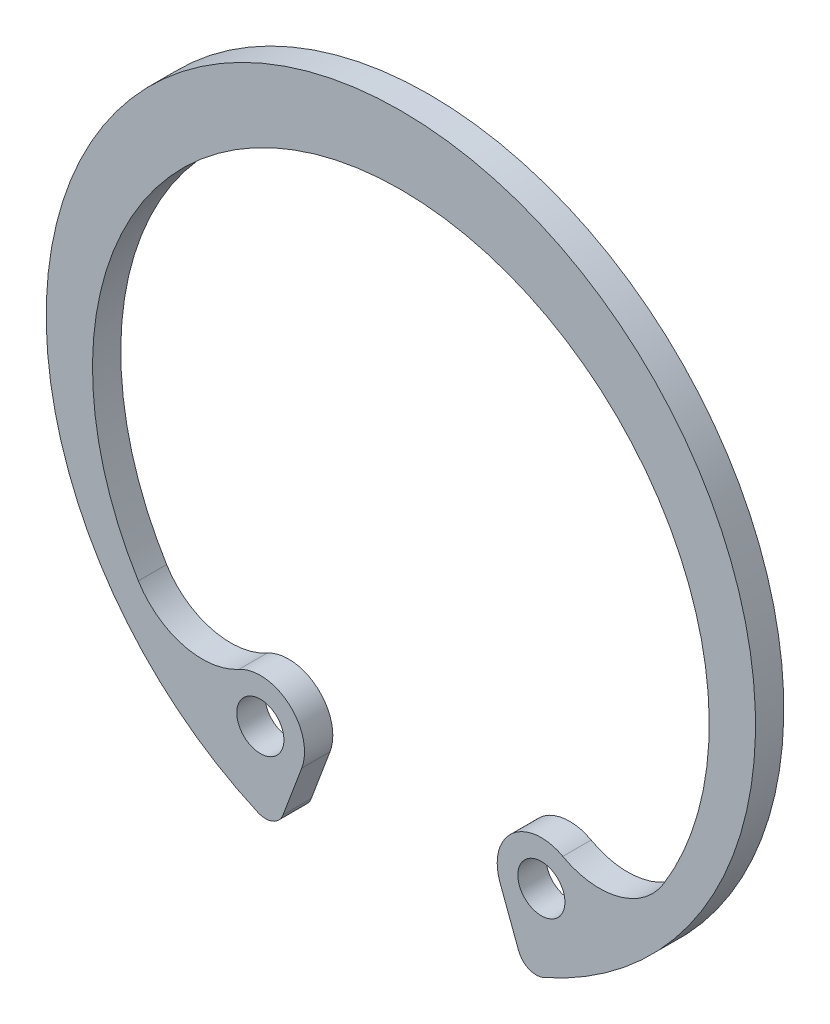
ISO-10303-21;
HEADER;
FILE_DESCRIPTION(('STEP AP214'),'2;1');
FILE_NAME('part.step','',(''),(''),'','','');
FILE_SCHEMA(('AUTOMOTIVE_DESIGN { 1 0 10303 214 1 1 1 1 }'));
ENDSEC;
DATA;
#1=APPLICATION_CONTEXT('core data for automotive mechanical design processes');
#2=APPLICATION_PROTOCOL_DEFINITION('international standard','automotive_design',2000,#1);
#3=PRODUCT_CONTEXT('',#1,'mechanical');
#4=PRODUCT('Part','Part','',(#3));
#5=PRODUCT_RELATED_PRODUCT_CATEGORY('part','',(#4));
#6=PRODUCT_DEFINITION_FORMATION('','',#4);
#7=PRODUCT_DEFINITION_CONTEXT('part definition',#1,'design');
#8=PRODUCT_DEFINITION('design','',#6,#7);
#9=PRODUCT_DEFINITION_SHAPE('','',#8);
#10=(LENGTH_UNIT() NAMED_UNIT(*) SI_UNIT(.MILLI.,.METRE.));
#11=(NAMED_UNIT(*) PLANE_ANGLE_UNIT() SI_UNIT($,.RADIAN.));
#12=(NAMED_UNIT(*) SI_UNIT($,.STERADIAN.) SOLID_ANGLE_UNIT());
#13=UNCERTAINTY_MEASURE_WITH_UNIT(LENGTH_MEASURE(1.E-05),#10,'distance_accuracy_value','');
#14=(GEOMETRIC_REPRESENTATION_CONTEXT(3) GLOBAL_UNCERTAINTY_ASSIGNED_CONTEXT((#13)) GLOBAL_UNIT_ASSIGNED_CONTEXT((#10,
#11,#12)) REPRESENTATION_CONTEXT('',''));
#15=CARTESIAN_POINT('',(0.,0.,0.));
#16=DIRECTION('',(0.,0.,1.));
#17=DIRECTION('',(1.,0.,0.));
#18=AXIS2_PLACEMENT_3D('',#15,#16,#17);
#19=CARTESIAN_POINT('',(0.,0.,-0.6));
#20=DIRECTION('',(0.,0.,1.));
#21=DIRECTION('',(1.,0.,0.));
#22=AXIS2_PLACEMENT_3D('',#19,#20,#21);
#23=CYLINDRICAL_SURFACE('',#22,15.05);
#24=CARTESIAN_POINT('',(0.,0.,0.6));
#25=DIRECTION('',(0.,0.,1.));
#26=DIRECTION('',(-1.,0.,0.));
#27=AXIS2_PLACEMENT_3D('',#24,#25,#26);
#28=CIRCLE('',#27,15.05);
#29=CARTESIAN_POINT('',(6.06221543211319,-13.7750515082394,0.6));
#30=VERTEX_POINT('',#29);
#31=CARTESIAN_POINT('',(-6.06221543211319,-13.7750515082394,0.6));
#32=VERTEX_POINT('',#31);
#33=EDGE_CURVE('E133',#30,#32,#28,.T.);
#34=ORIENTED_EDGE('',*,*,#33,.F.);
#35=DIRECTION('',(0.,0.,1.));
#36=VECTOR('',#35,1.);
#37=CARTESIAN_POINT('',(6.06221543211319,-13.7750515082394,-0.6));
#38=LINE('',#37,#36);
#39=CARTESIAN_POINT('',(6.06221543211319,-13.7750515082394,-0.6));
#40=VERTEX_POINT('',#39);
#41=EDGE_CURVE('E205',#30,#40,#38,.F.);
#42=ORIENTED_EDGE('',*,*,#41,.T.);
#43=CARTESIAN_POINT('',(0.,0.,-0.6));
#44=DIRECTION('',(0.,0.,1.));
#45=DIRECTION('',(-1.,0.,0.));
#46=AXIS2_PLACEMENT_3D('',#43,#44,#45);
#47=CIRCLE('',#46,15.05);
#48=CARTESIAN_POINT('',(-6.06221543211319,-13.7750515082394,-0.6));
#49=VERTEX_POINT('',#48);
#50=EDGE_CURVE('E168',#40,#49,#47,.T.);
#51=ORIENTED_EDGE('',*,*,#50,.T.);
#52=DIRECTION('',(0.,0.,1.));
#53=VECTOR('',#52,1.);
#54=CARTESIAN_POINT('',(-6.06221543211319,-13.7750515082394,-0.6));
#55=LINE('',#54,#53);
#56=EDGE_CURVE('E202',#49,#32,#55,.T.);
#57=ORIENTED_EDGE('',*,*,#56,.T.);
#58=EDGE_LOOP('',(#34,#42,#51,#57));
#59=FACE_BOUND('',#58,.T.);
#60=ADVANCED_FACE('F46',(#59),#23,.T.);
#61=CARTESIAN_POINT('',(4.2073107104936,-11.2159946765931,-0.6));
#62=DIRECTION('',(-0.936293145469634,-0.351219512195122,0.));
#63=DIRECTION('',(0.351219512195122,-0.936293145469634,0.));
#64=AXIS2_PLACEMENT_3D('',#61,#62,#63);
#65=PLANE('',#64);
#66=DIRECTION('',(0.351219512195122,-0.936293145469634,0.));
#67=VECTOR('',#66,1.);
#68=CARTESIAN_POINT('',(4.2073107104936,-11.2159946765931,-0.6));
#69=LINE('',#68,#67);
#70=CARTESIAN_POINT('',(4.2073107104936,-11.2159946765931,-0.6));
#71=VERTEX_POINT('',#70);
#72=CARTESIAN_POINT('',(4.99930626954186,-13.3273238807841,-0.6));
#73=VERTEX_POINT('',#72);
#74=EDGE_CURVE('E143',#71,#73,#69,.T.);
#75=ORIENTED_EDGE('',*,*,#74,.T.);
#76=DIRECTION('',(0.,0.,1.));
#77=VECTOR('',#76,1.);
#78=CARTESIAN_POINT('',(4.99930626954186,-13.3273238807841,-0.6));
#79=LINE('',#78,#77);
#80=CARTESIAN_POINT('',(4.99930626954186,-13.3273238807841,0.6));
#81=VERTEX_POINT('',#80);
#82=EDGE_CURVE('E189',#73,#81,#79,.T.);
#83=ORIENTED_EDGE('',*,*,#82,.T.);
#84=DIRECTION('',(0.351219512195122,-0.936293145469634,0.));
#85=VECTOR('',#84,1.);
#86=CARTESIAN_POINT('',(4.2073107104936,-11.2159946765931,0.6));
#87=LINE('',#86,#85);
#88=CARTESIAN_POINT('',(4.2073107104936,-11.2159946765931,0.6));
#89=VERTEX_POINT('',#88);
#90=EDGE_CURVE('E160',#89,#81,#87,.T.);
#91=ORIENTED_EDGE('',*,*,#90,.F.);
#92=DIRECTION('',(0.,0.,1.));
#93=VECTOR('',#92,1.);
#94=CARTESIAN_POINT('',(4.2073107104936,-11.2159946765931,-0.6));
#95=LINE('',#94,#93);
#96=EDGE_CURVE('E187',#71,#89,#95,.T.);
#97=ORIENTED_EDGE('',*,*,#96,.F.);
#98=EDGE_LOOP('',(#75,#83,#91,#97));
#99=FACE_BOUND('',#98,.T.);
#100=ADVANCED_FACE('F215',(#99),#65,.T.);
#101=CARTESIAN_POINT('',(5.96286035824916,-10.5574580912273,-0.6));
#102=DIRECTION('',(0.,0.,1.));
#103=DIRECTION('',(1.,0.,0.));
#104=AXIS2_PLACEMENT_3D('',#101,#102,#103);
#105=CYLINDRICAL_SURFACE('',#104,1.875);
#106=ORIENTED_EDGE('',*,*,#96,.T.);
#107=CARTESIAN_POINT('',(5.96286035824916,-10.5574580912273,0.6));
#108=DIRECTION('',(0.,0.,1.));
#109=DIRECTION('',(1.,0.,0.));
#110=AXIS2_PLACEMENT_3D('',#107,#108,#109);
#111=CIRCLE('',#110,1.875);
#112=CARTESIAN_POINT('',(6.87245354961913,-8.91786508495611,0.6));
#113=VERTEX_POINT('',#112);
#114=EDGE_CURVE('E157',#113,#89,#111,.T.);
#115=ORIENTED_EDGE('',*,*,#114,.F.);
#116=DIRECTION('',(0.,0.,1.));
#117=VECTOR('',#116,1.);
#118=CARTESIAN_POINT('',(6.87245354961913,-8.91786508495611,-0.6));
#119=LINE('',#118,#117);
#120=CARTESIAN_POINT('',(6.87245354961913,-8.91786508495611,-0.6));
#121=VERTEX_POINT('',#120);
#122=EDGE_CURVE('E190',#121,#113,#119,.T.);
#123=ORIENTED_EDGE('',*,*,#122,.F.);
#124=CARTESIAN_POINT('',(5.96286035824916,-10.5574580912273,-0.6));
#125=DIRECTION('',(0.,0.,1.));
#126=DIRECTION('',(1.,0.,0.));
#127=AXIS2_PLACEMENT_3D('',#124,#125,#126);
#128=CIRCLE('',#127,1.875);
#129=EDGE_CURVE('E182',#121,#71,#128,.T.);
#130=ORIENTED_EDGE('',*,*,#129,.T.);
#131=EDGE_LOOP('',(#106,#115,#123,#130));
#132=FACE_BOUND('',#131,.T.);
#133=ADVANCED_FACE('F245',(#132),#105,.T.);
#134=CARTESIAN_POINT('',(8.42168324532826,-6.12529121974654,-0.6));
#135=DIRECTION('',(0.,0.,1.));
#136=DIRECTION('',(1.,0.,0.));
#137=AXIS2_PLACEMENT_3D('',#134,#135,#136);
#138=CYLINDRICAL_SURFACE('',#137,3.1935217930552);
#139=ORIENTED_EDGE('',*,*,#122,.T.);
#140=CARTESIAN_POINT('',(8.42168324532826,-6.12529121974654,0.6));
#141=DIRECTION('',(0.,0.,-1.));
#142=DIRECTION('',(-1.,0.,0.));
#143=AXIS2_PLACEMENT_3D('',#140,#141,#142);
#144=CIRCLE('',#143,3.1935217930552);
#145=CARTESIAN_POINT('',(11.1404678023303,-7.80063953437429,0.6));
#146=VERTEX_POINT('',#145);
#147=EDGE_CURVE('E154',#146,#113,#144,.T.);
#148=ORIENTED_EDGE('',*,*,#147,.F.);
#149=DIRECTION('',(0.,0.,1.));
#150=VECTOR('',#149,1.);
#151=CARTESIAN_POINT('',(11.1404678023303,-7.80063953437429,-0.6));
#152=LINE('',#151,#150);
#153=CARTESIAN_POINT('',(11.1404678023303,-7.80063953437429,-0.6));
#154=VERTEX_POINT('',#153);
#155=EDGE_CURVE('E192',#154,#146,#152,.T.);
#156=ORIENTED_EDGE('',*,*,#155,.F.);
#157=CARTESIAN_POINT('',(8.42168324532826,-6.12529121974654,-0.6));
#158=DIRECTION('',(0.,0.,-1.));
#159=DIRECTION('',(-1.,0.,0.));
#160=AXIS2_PLACEMENT_3D('',#157,#158,#159);
#161=CIRCLE('',#160,3.1935217930552);
#162=EDGE_CURVE('E179',#154,#121,#161,.T.);
#163=ORIENTED_EDGE('',*,*,#162,.T.);
#164=EDGE_LOOP('',(#139,#148,#156,#163));
#165=FACE_BOUND('',#164,.T.);
#166=ADVANCED_FACE('F259',(#165),#138,.F.);
#167=CARTESIAN_POINT('',(0.,-0.935746945246263,-0.6));
#168=DIRECTION('',(0.,0.,1.));
#169=DIRECTION('',(1.,0.,0.));
#170=AXIS2_PLACEMENT_3D('',#167,#168,#169);
#171=CYLINDRICAL_SURFACE('',#170,13.0857469452463);
#172=ORIENTED_EDGE('',*,*,#155,.T.);
#173=CARTESIAN_POINT('',(0.,-0.935746945246263,0.6));
#174=DIRECTION('',(0.,0.,-1.));
#175=DIRECTION('',(-1.,0.,0.));
#176=AXIS2_PLACEMENT_3D('',#173,#174,#175);
#177=CIRCLE('',#176,13.0857469452463);
#178=CARTESIAN_POINT('',(-11.1404678023303,-7.80063953437428,0.6));
#179=VERTEX_POINT('',#178);
#180=EDGE_CURVE('E148',#179,#146,#177,.T.);
#181=ORIENTED_EDGE('',*,*,#180,.F.);
#182=DIRECTION('',(0.,0.,1.));
#183=VECTOR('',#182,1.);
#184=CARTESIAN_POINT('',(-11.1404678023303,-7.80063953437428,-0.6));
#185=LINE('',#184,#183);
#186=CARTESIAN_POINT('',(-11.1404678023303,-7.80063953437428,-0.6));
#187=VERTEX_POINT('',#186);
#188=EDGE_CURVE('E194',#187,#179,#185,.T.);
#189=ORIENTED_EDGE('',*,*,#188,.F.);
#190=CARTESIAN_POINT('',(0.,-0.935746945246263,-0.6));
#191=DIRECTION('',(0.,0.,-1.));
#192=DIRECTION('',(-1.,0.,0.));
#193=AXIS2_PLACEMENT_3D('',#190,#191,#192);
#194=CIRCLE('',#193,13.0857469452463);
#195=EDGE_CURVE('E176',#187,#154,#194,.T.);
#196=ORIENTED_EDGE('',*,*,#195,.T.);
#197=EDGE_LOOP('',(#172,#181,#189,#196));
#198=FACE_BOUND('',#197,.T.);
#199=ADVANCED_FACE('F255',(#198),#171,.F.);
#200=CARTESIAN_POINT('',(-8.42168324532826,-6.12529121974654,-0.6));
#201=DIRECTION('',(0.,0.,1.));
#202=DIRECTION('',(1.,0.,0.));
#203=AXIS2_PLACEMENT_3D('',#200,#201,#202);
#204=CYLINDRICAL_SURFACE('',#203,3.1935217930552);
#205=ORIENTED_EDGE('',*,*,#188,.T.);
#206=CARTESIAN_POINT('',(-8.42168324532826,-6.12529121974654,0.6));
#207=DIRECTION('',(0.,0.,-1.));
#208=DIRECTION('',(1.,0.,0.));
#209=AXIS2_PLACEMENT_3D('',#206,#207,#208);
#210=CIRCLE('',#209,3.1935217930552);
#211=CARTESIAN_POINT('',(-6.87245354961913,-8.91786508495611,0.6));
#212=VERTEX_POINT('',#211);
#213=EDGE_CURVE('E146',#212,#179,#210,.T.);
#214=ORIENTED_EDGE('',*,*,#213,.F.);
#215=DIRECTION('',(0.,0.,1.));
#216=VECTOR('',#215,1.);
#217=CARTESIAN_POINT('',(-6.87245354961913,-8.91786508495611,-0.6));
#218=LINE('',#217,#216);
#219=CARTESIAN_POINT('',(-6.87245354961913,-8.91786508495611,-0.6));
#220=VERTEX_POINT('',#219);
#221=EDGE_CURVE('E142',#220,#212,#218,.T.);
#222=ORIENTED_EDGE('',*,*,#221,.F.);
#223=CARTESIAN_POINT('',(-8.42168324532826,-6.12529121974654,-0.6));
#224=DIRECTION('',(0.,0.,-1.));
#225=DIRECTION('',(1.,0.,0.));
#226=AXIS2_PLACEMENT_3D('',#223,#224,#225);
#227=CIRCLE('',#226,3.1935217930552);
#228=EDGE_CURVE('E173',#220,#187,#227,.T.);
#229=ORIENTED_EDGE('',*,*,#228,.T.);
#230=EDGE_LOOP('',(#205,#214,#222,#229));
#231=FACE_BOUND('',#230,.T.);
#232=ADVANCED_FACE('F252',(#231),#204,.F.);
#233=CARTESIAN_POINT('',(-5.96286035824916,-10.5574580912273,-0.6));
#234=DIRECTION('',(0.,0.,1.));
#235=DIRECTION('',(1.,0.,0.));
#236=AXIS2_PLACEMENT_3D('',#233,#234,#235);
#237=CYLINDRICAL_SURFACE('',#236,1.875);
#238=ORIENTED_EDGE('',*,*,#221,.T.);
#239=CARTESIAN_POINT('',(-5.96286035824916,-10.5574580912273,0.6));
#240=DIRECTION('',(0.,0.,1.));
#241=DIRECTION('',(-1.,0.,0.));
#242=AXIS2_PLACEMENT_3D('',#239,#240,#241);
#243=CIRCLE('',#242,1.875);
#244=CARTESIAN_POINT('',(-4.2073107104936,-11.2159946765931,0.6));
#245=VERTEX_POINT('',#244);
#246=EDGE_CURVE('E129',#245,#212,#243,.T.);
#247=ORIENTED_EDGE('',*,*,#246,.F.);
#248=DIRECTION('',(0.,0.,1.));
#249=VECTOR('',#248,1.);
#250=CARTESIAN_POINT('',(-4.2073107104936,-11.2159946765931,-0.6));
#251=LINE('',#250,#249);
#252=CARTESIAN_POINT('',(-4.2073107104936,-11.2159946765931,-0.6));
#253=VERTEX_POINT('',#252);
#254=EDGE_CURVE('E136',#253,#245,#251,.T.);
#255=ORIENTED_EDGE('',*,*,#254,.F.);
#256=CARTESIAN_POINT('',(-5.96286035824916,-10.5574580912273,-0.6));
#257=DIRECTION('',(0.,0.,1.));
#258=DIRECTION('',(-1.,0.,0.));
#259=AXIS2_PLACEMENT_3D('',#256,#257,#258);
#260=CIRCLE('',#259,1.875);
#261=EDGE_CURVE('E171',#253,#220,#260,.T.);
#262=ORIENTED_EDGE('',*,*,#261,.T.);
#263=EDGE_LOOP('',(#238,#247,#255,#262));
#264=FACE_BOUND('',#263,.T.);
#265=ADVANCED_FACE('F145',(#264),#237,.T.);
#266=CARTESIAN_POINT('',(-4.2073107104936,-11.2159946765931,-0.6));
#267=DIRECTION('',(0.936293145469634,-0.351219512195122,0.));
#268=DIRECTION('',(0.351219512195122,0.936293145469634,0.));
#269=AXIS2_PLACEMENT_3D('',#266,#267,#268);
#270=PLANE('',#269);
#271=DIRECTION('',(0.351219512195122,0.936293145469634,0.));
#272=VECTOR('',#271,1.);
#273=CARTESIAN_POINT('',(-4.2073107104936,-11.2159946765931,0.6));
#274=LINE('',#273,#272);
#275=CARTESIAN_POINT('',(-4.99930626954186,-13.3273238807841,0.6));
#276=VERTEX_POINT('',#275);
#277=EDGE_CURVE('E122',#276,#245,#274,.T.);
#278=ORIENTED_EDGE('',*,*,#277,.F.);
#279=DIRECTION('',(0.,0.,1.));
#280=VECTOR('',#279,1.);
#281=CARTESIAN_POINT('',(-4.99930626954186,-13.3273238807841,-0.6));
#282=LINE('',#281,#280);
#283=CARTESIAN_POINT('',(-4.99930626954186,-13.3273238807841,-0.6));
#284=VERTEX_POINT('',#283);
#285=EDGE_CURVE('E13',#276,#284,#282,.F.);
#286=ORIENTED_EDGE('',*,*,#285,.T.);
#287=DIRECTION('',(0.351219512195122,0.936293145469634,0.));
#288=VECTOR('',#287,1.);
#289=CARTESIAN_POINT('',(-4.2073107104936,-11.2159946765931,-0.6));
#290=LINE('',#289,#288);
#291=EDGE_CURVE('E138',#284,#253,#290,.T.);
#292=ORIENTED_EDGE('',*,*,#291,.T.);
#293=ORIENTED_EDGE('',*,*,#254,.T.);
#294=EDGE_LOOP('',(#278,#286,#292,#293));
#295=FACE_BOUND('',#294,.T.);
#296=ADVANCED_FACE('F137',(#295),#270,.T.);
#297=CARTESIAN_POINT('',(0.,0.,-0.6));
#298=DIRECTION('',(0.,0.,-1.));
#299=DIRECTION('',(-1.,0.,0.));
#300=AXIS2_PLACEMENT_3D('',#297,#298,#299);
#301=PLANE('',#300);
#302=CARTESIAN_POINT('',(5.96286035824916,-10.5574580912273,-0.6));
#303=DIRECTION('',(0.,0.,1.));
#304=DIRECTION('',(-1.,0.,0.));
#305=AXIS2_PLACEMENT_3D('',#302,#303,#304);
#306=CIRCLE('',#305,1.);
#307=CARTESIAN_POINT('',(4.96286035824916,-10.5574580912273,-0.6));
#308=VERTEX_POINT('',#307);
#309=EDGE_CURVE('E162',#308,#308,#306,.T.);
#310=ORIENTED_EDGE('',*,*,#309,.T.);
#311=EDGE_LOOP('',(#310));
#312=FACE_BOUND('',#311,.T.);
#313=CARTESIAN_POINT('',(-5.96286035824916,-10.5574580912273,-0.6));
#314=DIRECTION('',(0.,0.,1.));
#315=DIRECTION('',(1.,0.,0.));
#316=AXIS2_PLACEMENT_3D('',#313,#314,#315);
#317=CIRCLE('',#316,1.);
#318=CARTESIAN_POINT('',(-4.96286035824916,-10.5574580912273,-0.6));
#319=VERTEX_POINT('',#318);
#320=EDGE_CURVE('E165',#319,#319,#317,.T.);
#321=ORIENTED_EDGE('',*,*,#320,.T.);
#322=EDGE_LOOP('',(#321));
#323=FACE_BOUND('',#322,.T.);
#324=ORIENTED_EDGE('',*,*,#50,.F.);
#325=CARTESIAN_POINT('',(5.74248895375838,-13.0485433929793,-0.6));
#326=DIRECTION('',(0.,0.,-1.));
#327=DIRECTION('',(-1.,0.,0.));
#328=AXIS2_PLACEMENT_3D('',#325,#326,#327);
#329=CIRCLE('',#328,0.79375);
#330=EDGE_CURVE('E54',#40,#73,#329,.T.);
#331=ORIENTED_EDGE('',*,*,#330,.T.);
#332=ORIENTED_EDGE('',*,*,#74,.F.);
#333=ORIENTED_EDGE('',*,*,#129,.F.);
#334=ORIENTED_EDGE('',*,*,#162,.F.);
#335=ORIENTED_EDGE('',*,*,#195,.F.);
#336=ORIENTED_EDGE('',*,*,#228,.F.);
#337=ORIENTED_EDGE('',*,*,#261,.F.);
#338=ORIENTED_EDGE('',*,*,#291,.F.);
#339=CARTESIAN_POINT('',(-5.74248895375838,-13.0485433929793,-0.6));
#340=DIRECTION('',(0.,0.,-1.));
#341=DIRECTION('',(-1.,0.,0.));
#342=AXIS2_PLACEMENT_3D('',#339,#340,#341);
#343=CIRCLE('',#342,0.79375);
#344=EDGE_CURVE('E66',#284,#49,#343,.T.);
#345=ORIENTED_EDGE('',*,*,#344,.T.);
#346=EDGE_LOOP('',(#324,#331,#332,#333,#334,#335,#336,#337,#338,#345));
#347=FACE_BOUND('',#346,.T.);
#348=ADVANCED_FACE('F209',(#312,#323,#347),#301,.T.);
#349=CARTESIAN_POINT('',(-5.96286035824916,-10.5574580912273,-0.6));
#350=DIRECTION('',(0.,0.,1.));
#351=DIRECTION('',(1.,0.,0.));
#352=AXIS2_PLACEMENT_3D('',#349,#350,#351);
#353=CYLINDRICAL_SURFACE('',#352,1.);
#354=ORIENTED_EDGE('',*,*,#320,.F.);
#355=EDGE_LOOP('',(#354));
#356=FACE_BOUND('',#355,.T.);
#357=CARTESIAN_POINT('',(-5.96286035824916,-10.5574580912273,0.6));
#358=DIRECTION('',(0.,0.,1.));
#359=DIRECTION('',(1.,0.,0.));
#360=AXIS2_PLACEMENT_3D('',#357,#358,#359);
#361=CIRCLE('',#360,1.);
#362=CARTESIAN_POINT('',(-4.96286035824916,-10.5574580912273,0.6));
#363=VERTEX_POINT('',#362);
#364=EDGE_CURVE('E221',#363,#363,#361,.T.);
#365=ORIENTED_EDGE('',*,*,#364,.T.);
#366=EDGE_LOOP('',(#365));
#367=FACE_BOUND('',#366,.T.);
#368=ADVANCED_FACE('F237',(#356,#367),#353,.F.);
#369=CARTESIAN_POINT('',(5.96286035824916,-10.5574580912273,-0.6));
#370=DIRECTION('',(0.,0.,1.));
#371=DIRECTION('',(1.,0.,0.));
#372=AXIS2_PLACEMENT_3D('',#369,#370,#371);
#373=CYLINDRICAL_SURFACE('',#372,1.);
#374=ORIENTED_EDGE('',*,*,#309,.F.);
#375=EDGE_LOOP('',(#374));
#376=FACE_BOUND('',#375,.T.);
#377=CARTESIAN_POINT('',(5.96286035824916,-10.5574580912273,0.6));
#378=DIRECTION('',(0.,0.,1.));
#379=DIRECTION('',(-1.,0.,0.));
#380=AXIS2_PLACEMENT_3D('',#377,#378,#379);
#381=CIRCLE('',#380,1.);
#382=CARTESIAN_POINT('',(4.96286035824916,-10.5574580912273,0.6));
#383=VERTEX_POINT('',#382);
#384=EDGE_CURVE('E223',#383,#383,#381,.T.);
#385=ORIENTED_EDGE('',*,*,#384,.T.);
#386=EDGE_LOOP('',(#385));
#387=FACE_BOUND('',#386,.T.);
#388=ADVANCED_FACE('F229',(#376,#387),#373,.F.);
#389=CARTESIAN_POINT('',(0.,0.,0.6));
#390=DIRECTION('',(0.,0.,-1.));
#391=DIRECTION('',(-1.,0.,0.));
#392=AXIS2_PLACEMENT_3D('',#389,#390,#391);
#393=PLANE('',#392);
#394=ORIENTED_EDGE('',*,*,#90,.T.);
#395=CARTESIAN_POINT('',(5.74248895375838,-13.0485433929793,0.6));
#396=DIRECTION('',(0.,0.,-1.));
#397=DIRECTION('',(-1.,0.,0.));
#398=AXIS2_PLACEMENT_3D('',#395,#396,#397);
#399=CIRCLE('',#398,0.79375);
#400=EDGE_CURVE('E200',#81,#30,#399,.F.);
#401=ORIENTED_EDGE('',*,*,#400,.T.);
#402=ORIENTED_EDGE('',*,*,#33,.T.);
#403=CARTESIAN_POINT('',(-5.74248895375838,-13.0485433929793,0.6));
#404=DIRECTION('',(0.,0.,-1.));
#405=DIRECTION('',(-1.,0.,0.));
#406=AXIS2_PLACEMENT_3D('',#403,#404,#405);
#407=CIRCLE('',#406,0.79375);
#408=EDGE_CURVE('E132',#32,#276,#407,.F.);
#409=ORIENTED_EDGE('',*,*,#408,.T.);
#410=ORIENTED_EDGE('',*,*,#277,.T.);
#411=ORIENTED_EDGE('',*,*,#246,.T.);
#412=ORIENTED_EDGE('',*,*,#213,.T.);
#413=ORIENTED_EDGE('',*,*,#180,.T.);
#414=ORIENTED_EDGE('',*,*,#147,.T.);
#415=ORIENTED_EDGE('',*,*,#114,.T.);
#416=EDGE_LOOP('',(#394,#401,#402,#409,#410,#411,#412,#413,#414,#415));
#417=FACE_BOUND('',#416,.T.);
#418=ORIENTED_EDGE('',*,*,#364,.F.);
#419=EDGE_LOOP('',(#418));
#420=FACE_BOUND('',#419,.T.);
#421=ORIENTED_EDGE('',*,*,#384,.F.);
#422=EDGE_LOOP('',(#421));
#423=FACE_BOUND('',#422,.T.);
#424=ADVANCED_FACE('F125',(#417,#420,#423),#393,.F.);
#425=CARTESIAN_POINT('',(5.74248895375838,-13.0485433929793,-0.6));
#426=DIRECTION('',(0.,0.,1.));
#427=DIRECTION('',(1.,0.,0.));
#428=AXIS2_PLACEMENT_3D('',#425,#426,#427);
#429=CYLINDRICAL_SURFACE('',#428,0.79375);
#430=ORIENTED_EDGE('',*,*,#330,.F.);
#431=ORIENTED_EDGE('',*,*,#41,.F.);
#432=ORIENTED_EDGE('',*,*,#400,.F.);
#433=ORIENTED_EDGE('',*,*,#82,.F.);
#434=EDGE_LOOP('',(#430,#431,#432,#433));
#435=FACE_BOUND('',#434,.T.);
#436=ADVANCED_FACE('F217',(#435),#429,.T.);
#437=CARTESIAN_POINT('',(-5.74248895375838,-13.0485433929793,-0.6));
#438=DIRECTION('',(0.,0.,1.));
#439=DIRECTION('',(1.,0.,0.));
#440=AXIS2_PLACEMENT_3D('',#437,#438,#439);
#441=CYLINDRICAL_SURFACE('',#440,0.79375);
#442=ORIENTED_EDGE('',*,*,#344,.F.);
#443=ORIENTED_EDGE('',*,*,#285,.F.);
#444=ORIENTED_EDGE('',*,*,#408,.F.);
#445=ORIENTED_EDGE('',*,*,#56,.F.);
#446=EDGE_LOOP('',(#442,#443,#444,#445));
#447=FACE_BOUND('',#446,.T.);
#448=ADVANCED_FACE('F48',(#447),#441,.T.);
#449=CLOSED_SHELL('',(#60,#100,#133,#166,#199,#232,#265,#296,#348,#368,#388,#424,#436,#448));
#450=MANIFOLD_SOLID_BREP('B2',#449);
#451=ADVANCED_BREP_SHAPE_REPRESENTATION('',(#18,#450),#14);
#452=SHAPE_DEFINITION_REPRESENTATION(#9,#451);
ENDSEC;
END-ISO-10303-21;
